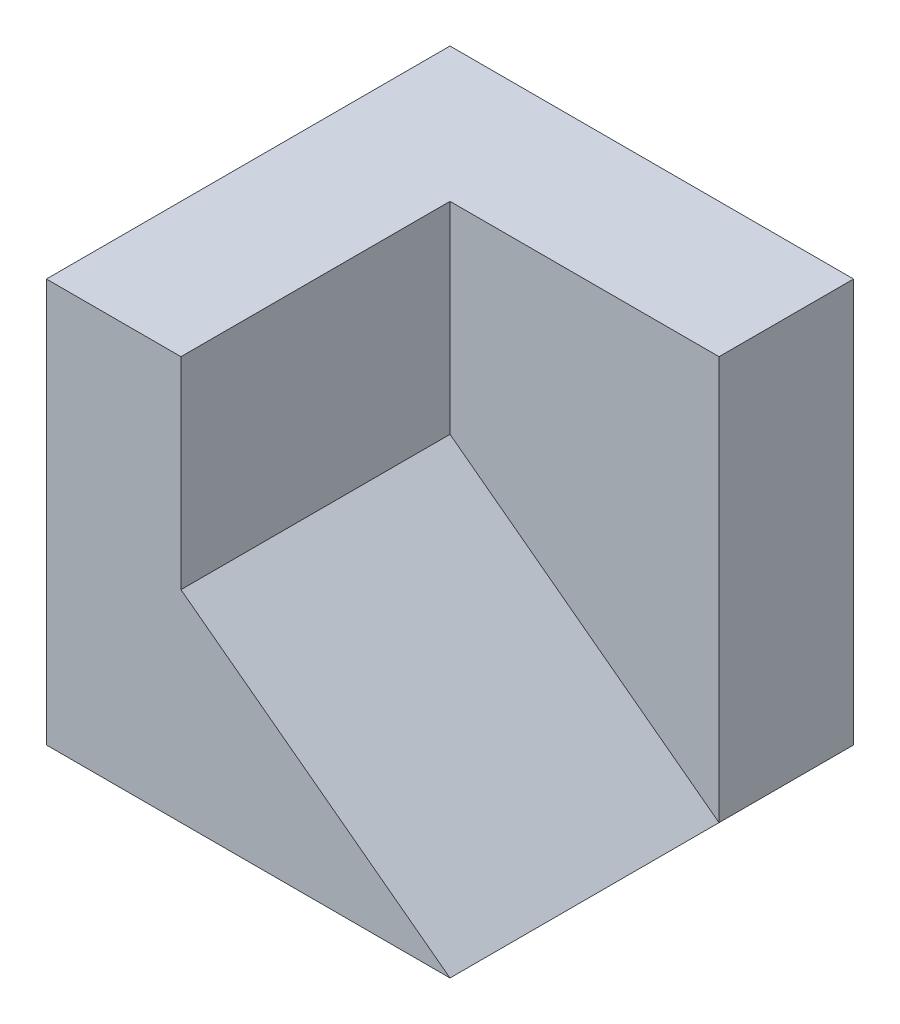
ISO-10303-21;
HEADER;
FILE_DESCRIPTION(('STEP AP214'),'2;1');
FILE_NAME('part.step','',(''),(''),'','','');
FILE_SCHEMA(('AUTOMOTIVE_DESIGN { 1 0 10303 214 1 1 1 1 }'));
ENDSEC;
DATA;
#1=APPLICATION_CONTEXT('core data for automotive mechanical design processes');
#2=APPLICATION_PROTOCOL_DEFINITION('international standard','automotive_design',2000,#1);
#3=PRODUCT_CONTEXT('',#1,'mechanical');
#4=PRODUCT('Part','Part','',(#3));
#5=PRODUCT_RELATED_PRODUCT_CATEGORY('part','',(#4));
#6=PRODUCT_DEFINITION_FORMATION('','',#4);
#7=PRODUCT_DEFINITION_CONTEXT('part definition',#1,'design');
#8=PRODUCT_DEFINITION('design','',#6,#7);
#9=PRODUCT_DEFINITION_SHAPE('','',#8);
#10=(LENGTH_UNIT() NAMED_UNIT(*) SI_UNIT(.MILLI.,.METRE.));
#11=(NAMED_UNIT(*) PLANE_ANGLE_UNIT() SI_UNIT($,.RADIAN.));
#12=(NAMED_UNIT(*) SI_UNIT($,.STERADIAN.) SOLID_ANGLE_UNIT());
#13=UNCERTAINTY_MEASURE_WITH_UNIT(LENGTH_MEASURE(1.E-05),#10,'distance_accuracy_value','');
#14=(GEOMETRIC_REPRESENTATION_CONTEXT(3) GLOBAL_UNCERTAINTY_ASSIGNED_CONTEXT((#13)) GLOBAL_UNIT_ASSIGNED_CONTEXT((#10,
#11,#12)) REPRESENTATION_CONTEXT('',''));
#15=CARTESIAN_POINT('',(0.,0.,0.));
#16=DIRECTION('',(0.,0.,1.));
#17=DIRECTION('',(1.,0.,0.));
#18=AXIS2_PLACEMENT_3D('',#15,#16,#17);
#19=CARTESIAN_POINT('',(60.,60.,0.));
#20=DIRECTION('',(-1.,0.,0.));
#21=DIRECTION('',(0.,0.,1.));
#22=AXIS2_PLACEMENT_3D('',#19,#20,#21);
#23=PLANE('',#22);
#24=DIRECTION('',(0.,1.,0.));
#25=VECTOR('',#24,1.);
#26=CARTESIAN_POINT('',(60.,30.,20.));
#27=LINE('',#26,#25);
#28=CARTESIAN_POINT('',(60.,0.,20.));
#29=VERTEX_POINT('',#28);
#30=CARTESIAN_POINT('',(60.,60.,20.));
#31=VERTEX_POINT('',#30);
#32=EDGE_CURVE('E55',#29,#31,#27,.T.);
#33=ORIENTED_EDGE('',*,*,#32,.F.);
#34=DIRECTION('',(0.,0.,-1.));
#35=VECTOR('',#34,1.);
#36=CARTESIAN_POINT('',(60.,0.,0.));
#37=LINE('',#36,#35);
#38=CARTESIAN_POINT('',(60.,0.,0.));
#39=VERTEX_POINT('',#38);
#40=EDGE_CURVE('E109',#29,#39,#37,.T.);
#41=ORIENTED_EDGE('',*,*,#40,.T.);
#42=DIRECTION('',(0.,-1.,0.));
#43=VECTOR('',#42,1.);
#44=CARTESIAN_POINT('',(60.,60.,0.));
#45=LINE('',#44,#43);
#46=CARTESIAN_POINT('',(60.,60.,0.));
#47=VERTEX_POINT('',#46);
#48=EDGE_CURVE('E48',#47,#39,#45,.T.);
#49=ORIENTED_EDGE('',*,*,#48,.F.);
#50=DIRECTION('',(0.,0.,-1.));
#51=VECTOR('',#50,1.);
#52=CARTESIAN_POINT('',(60.,60.,0.));
#53=LINE('',#52,#51);
#54=EDGE_CURVE('E110',#31,#47,#53,.T.);
#55=ORIENTED_EDGE('',*,*,#54,.F.);
#56=EDGE_LOOP('',(#33,#41,#49,#55));
#57=FACE_BOUND('',#56,.T.);
#58=ADVANCED_FACE('F39',(#57),#23,.F.);
#59=CARTESIAN_POINT('',(0.,60.,0.));
#60=DIRECTION('',(1.,0.,0.));
#61=DIRECTION('',(0.,0.,-1.));
#62=AXIS2_PLACEMENT_3D('',#59,#60,#61);
#63=PLANE('',#62);
#64=DIRECTION('',(0.,0.,1.));
#65=VECTOR('',#64,1.);
#66=CARTESIAN_POINT('',(0.,0.,0.));
#67=LINE('',#66,#65);
#68=CARTESIAN_POINT('',(0.,0.,0.));
#69=VERTEX_POINT('',#68);
#70=CARTESIAN_POINT('',(0.,0.,60.));
#71=VERTEX_POINT('',#70);
#72=EDGE_CURVE('E137',#69,#71,#67,.T.);
#73=ORIENTED_EDGE('',*,*,#72,.T.);
#74=DIRECTION('',(0.,-1.,0.));
#75=VECTOR('',#74,1.);
#76=CARTESIAN_POINT('',(0.,60.,60.));
#77=LINE('',#76,#75);
#78=CARTESIAN_POINT('',(0.,60.,60.));
#79=VERTEX_POINT('',#78);
#80=EDGE_CURVE('E11',#79,#71,#77,.T.);
#81=ORIENTED_EDGE('',*,*,#80,.F.);
#82=DIRECTION('',(0.,0.,1.));
#83=VECTOR('',#82,1.);
#84=CARTESIAN_POINT('',(0.,60.,0.));
#85=LINE('',#84,#83);
#86=CARTESIAN_POINT('',(0.,60.,0.));
#87=VERTEX_POINT('',#86);
#88=EDGE_CURVE('E143',#87,#79,#85,.T.);
#89=ORIENTED_EDGE('',*,*,#88,.F.);
#90=DIRECTION('',(0.,-1.,0.));
#91=VECTOR('',#90,1.);
#92=CARTESIAN_POINT('',(0.,60.,0.));
#93=LINE('',#92,#91);
#94=EDGE_CURVE('E144',#87,#69,#93,.T.);
#95=ORIENTED_EDGE('',*,*,#94,.T.);
#96=EDGE_LOOP('',(#73,#81,#89,#95));
#97=FACE_BOUND('',#96,.T.);
#98=ADVANCED_FACE('F41',(#97),#63,.F.);
#99=CARTESIAN_POINT('',(0.,60.,60.));
#100=DIRECTION('',(0.,0.,-1.));
#101=DIRECTION('',(-1.,0.,0.));
#102=AXIS2_PLACEMENT_3D('',#99,#100,#101);
#103=PLANE('',#102);
#104=DIRECTION('',(1.,0.,0.));
#105=VECTOR('',#104,1.);
#106=CARTESIAN_POINT('',(0.,0.,60.));
#107=LINE('',#106,#105);
#108=CARTESIAN_POINT('',(60.,0.,60.));
#109=VERTEX_POINT('',#108);
#110=EDGE_CURVE('E135',#71,#109,#107,.T.);
#111=ORIENTED_EDGE('',*,*,#110,.T.);
#112=DIRECTION('',(0.8,-0.6,0.));
#113=VECTOR('',#112,1.);
#114=CARTESIAN_POINT('',(60.,0.,60.));
#115=LINE('',#114,#113);
#116=CARTESIAN_POINT('',(20.,30.,60.));
#117=VERTEX_POINT('',#116);
#118=EDGE_CURVE('E122',#117,#109,#115,.T.);
#119=ORIENTED_EDGE('',*,*,#118,.F.);
#120=DIRECTION('',(0.,1.,0.));
#121=VECTOR('',#120,1.);
#122=CARTESIAN_POINT('',(20.,30.,60.));
#123=LINE('',#122,#121);
#124=CARTESIAN_POINT('',(20.,60.,60.));
#125=VERTEX_POINT('',#124);
#126=EDGE_CURVE('E156',#117,#125,#123,.T.);
#127=ORIENTED_EDGE('',*,*,#126,.T.);
#128=DIRECTION('',(1.,0.,0.));
#129=VECTOR('',#128,1.);
#130=CARTESIAN_POINT('',(0.,60.,60.));
#131=LINE('',#130,#129);
#132=EDGE_CURVE('E87',#79,#125,#131,.T.);
#133=ORIENTED_EDGE('',*,*,#132,.F.);
#134=ORIENTED_EDGE('',*,*,#80,.T.);
#135=EDGE_LOOP('',(#111,#119,#127,#133,#134));
#136=FACE_BOUND('',#135,.T.);
#137=ADVANCED_FACE('F172',(#136),#103,.F.);
#138=CARTESIAN_POINT('',(0.,60.,0.));
#139=DIRECTION('',(0.,0.,1.));
#140=DIRECTION('',(1.,0.,0.));
#141=AXIS2_PLACEMENT_3D('',#138,#139,#140);
#142=PLANE('',#141);
#143=DIRECTION('',(-1.,0.,0.));
#144=VECTOR('',#143,1.);
#145=CARTESIAN_POINT('',(0.,0.,0.));
#146=LINE('',#145,#144);
#147=EDGE_CURVE('E81',#39,#69,#146,.T.);
#148=ORIENTED_EDGE('',*,*,#147,.T.);
#149=ORIENTED_EDGE('',*,*,#94,.F.);
#150=DIRECTION('',(-1.,0.,0.));
#151=VECTOR('',#150,1.);
#152=CARTESIAN_POINT('',(0.,60.,0.));
#153=LINE('',#152,#151);
#154=EDGE_CURVE('E64',#47,#87,#153,.T.);
#155=ORIENTED_EDGE('',*,*,#154,.F.);
#156=ORIENTED_EDGE('',*,*,#48,.T.);
#157=EDGE_LOOP('',(#148,#149,#155,#156));
#158=FACE_BOUND('',#157,.T.);
#159=ADVANCED_FACE('F147',(#158),#142,.F.);
#160=CARTESIAN_POINT('',(0.,60.,0.));
#161=DIRECTION('',(0.,1.,0.));
#162=DIRECTION('',(0.,0.,1.));
#163=AXIS2_PLACEMENT_3D('',#160,#161,#162);
#164=PLANE('',#163);
#165=DIRECTION('',(0.,0.,1.));
#166=VECTOR('',#165,1.);
#167=CARTESIAN_POINT('',(20.,60.,20.));
#168=LINE('',#167,#166);
#169=CARTESIAN_POINT('',(20.,60.,20.));
#170=VERTEX_POINT('',#169);
#171=EDGE_CURVE('E165',#170,#125,#168,.T.);
#172=ORIENTED_EDGE('',*,*,#171,.F.);
#173=DIRECTION('',(-1.,0.,0.));
#174=VECTOR('',#173,1.);
#175=CARTESIAN_POINT('',(20.,60.,20.));
#176=LINE('',#175,#174);
#177=EDGE_CURVE('E130',#31,#170,#176,.T.);
#178=ORIENTED_EDGE('',*,*,#177,.F.);
#179=ORIENTED_EDGE('',*,*,#54,.T.);
#180=ORIENTED_EDGE('',*,*,#154,.T.);
#181=ORIENTED_EDGE('',*,*,#88,.T.);
#182=ORIENTED_EDGE('',*,*,#132,.T.);
#183=EDGE_LOOP('',(#172,#178,#179,#180,#181,#182));
#184=FACE_BOUND('',#183,.T.);
#185=ADVANCED_FACE('F171',(#184),#164,.T.);
#186=CARTESIAN_POINT('',(0.,0.,0.));
#187=DIRECTION('',(0.,1.,0.));
#188=DIRECTION('',(0.,0.,1.));
#189=AXIS2_PLACEMENT_3D('',#186,#187,#188);
#190=PLANE('',#189);
#191=ORIENTED_EDGE('',*,*,#72,.F.);
#192=ORIENTED_EDGE('',*,*,#147,.F.);
#193=ORIENTED_EDGE('',*,*,#40,.F.);
#194=EDGE_CURVE('E117',#109,#29,#37,.T.);
#195=ORIENTED_EDGE('',*,*,#194,.F.);
#196=ORIENTED_EDGE('',*,*,#110,.F.);
#197=EDGE_LOOP('',(#191,#192,#193,#195,#196));
#198=FACE_BOUND('',#197,.T.);
#199=ADVANCED_FACE('F133',(#198),#190,.F.);
#200=CARTESIAN_POINT('',(20.,30.,20.));
#201=DIRECTION('',(-1.,0.,0.));
#202=DIRECTION('',(0.,0.,1.));
#203=AXIS2_PLACEMENT_3D('',#200,#201,#202);
#204=PLANE('',#203);
#205=ORIENTED_EDGE('',*,*,#171,.T.);
#206=ORIENTED_EDGE('',*,*,#126,.F.);
#207=DIRECTION('',(0.,0.,1.));
#208=VECTOR('',#207,1.);
#209=CARTESIAN_POINT('',(20.,30.,20.));
#210=LINE('',#209,#208);
#211=CARTESIAN_POINT('',(20.,30.,20.));
#212=VERTEX_POINT('',#211);
#213=EDGE_CURVE('E113',#212,#117,#210,.T.);
#214=ORIENTED_EDGE('',*,*,#213,.F.);
#215=DIRECTION('',(0.,1.,0.));
#216=VECTOR('',#215,1.);
#217=CARTESIAN_POINT('',(20.,30.,20.));
#218=LINE('',#217,#216);
#219=EDGE_CURVE('E112',#212,#170,#218,.T.);
#220=ORIENTED_EDGE('',*,*,#219,.T.);
#221=EDGE_LOOP('',(#205,#206,#214,#220));
#222=FACE_BOUND('',#221,.T.);
#223=ADVANCED_FACE('F176',(#222),#204,.F.);
#224=CARTESIAN_POINT('',(20.,30.,20.));
#225=DIRECTION('',(0.,0.,-1.));
#226=DIRECTION('',(-1.,0.,0.));
#227=AXIS2_PLACEMENT_3D('',#224,#225,#226);
#228=PLANE('',#227);
#229=ORIENTED_EDGE('',*,*,#177,.T.);
#230=ORIENTED_EDGE('',*,*,#219,.F.);
#231=DIRECTION('',(0.8,-0.6,0.));
#232=VECTOR('',#231,1.);
#233=CARTESIAN_POINT('',(60.,0.,20.));
#234=LINE('',#233,#232);
#235=EDGE_CURVE('E119',#212,#29,#234,.T.);
#236=ORIENTED_EDGE('',*,*,#235,.T.);
#237=ORIENTED_EDGE('',*,*,#32,.T.);
#238=EDGE_LOOP('',(#229,#230,#236,#237));
#239=FACE_BOUND('',#238,.T.);
#240=ADVANCED_FACE('F127',(#239),#228,.F.);
#241=CARTESIAN_POINT('',(60.,0.,20.));
#242=DIRECTION('',(-0.6,-0.8,0.));
#243=DIRECTION('',(0.8,-0.6,0.));
#244=AXIS2_PLACEMENT_3D('',#241,#242,#243);
#245=PLANE('',#244);
#246=ORIENTED_EDGE('',*,*,#118,.T.);
#247=ORIENTED_EDGE('',*,*,#194,.T.);
#248=ORIENTED_EDGE('',*,*,#235,.F.);
#249=ORIENTED_EDGE('',*,*,#213,.T.);
#250=EDGE_LOOP('',(#246,#247,#248,#249));
#251=FACE_BOUND('',#250,.T.);
#252=ADVANCED_FACE('F118',(#251),#245,.F.);
#253=CLOSED_SHELL('',(#58,#98,#137,#159,#185,#199,#223,#240,#252));
#254=MANIFOLD_SOLID_BREP('B2',#253);
#255=ADVANCED_BREP_SHAPE_REPRESENTATION('',(#18,#254),#14);
#256=SHAPE_DEFINITION_REPRESENTATION(#9,#255);
ENDSEC;
END-ISO-10303-21;
